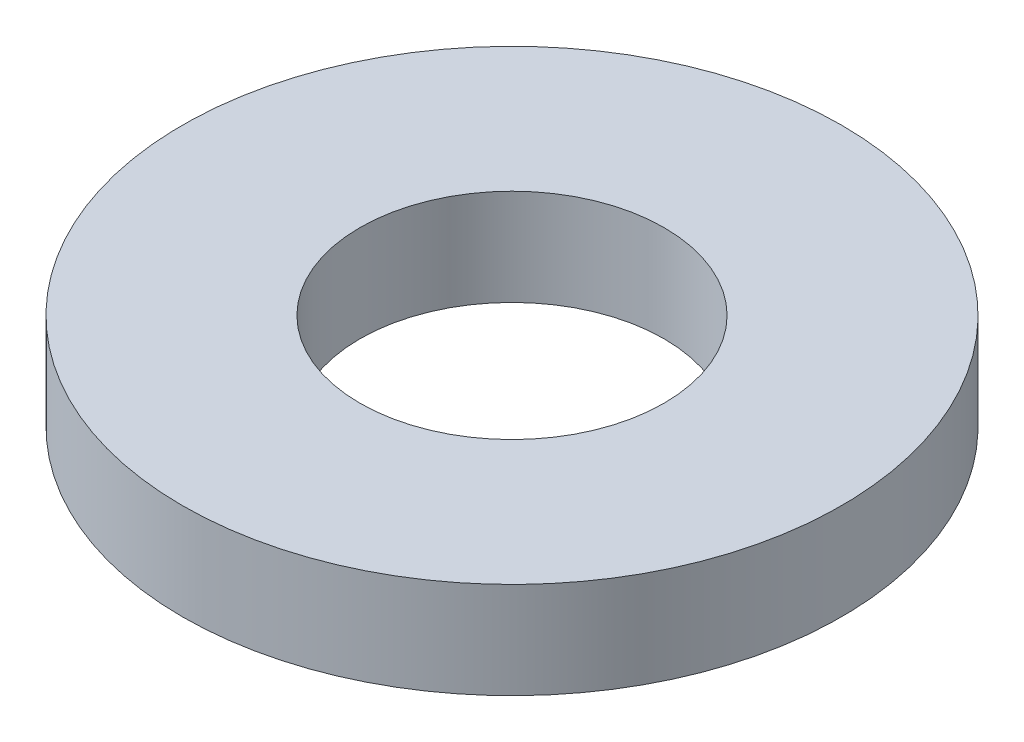
ISO-10303-21;
HEADER;
FILE_DESCRIPTION(('STEP AP214'),'2;1');
FILE_NAME('part.step','',(''),(''),'','','');
FILE_SCHEMA(('AUTOMOTIVE_DESIGN { 1 0 10303 214 1 1 1 1 }'));
ENDSEC;
DATA;
#1=APPLICATION_CONTEXT('core data for automotive mechanical design processes');
#2=APPLICATION_PROTOCOL_DEFINITION('international standard','automotive_design',2000,#1);
#3=PRODUCT_CONTEXT('',#1,'mechanical');
#4=PRODUCT('Part','Part','',(#3));
#5=PRODUCT_RELATED_PRODUCT_CATEGORY('part','',(#4));
#6=PRODUCT_DEFINITION_FORMATION('','',#4);
#7=PRODUCT_DEFINITION_CONTEXT('part definition',#1,'design');
#8=PRODUCT_DEFINITION('design','',#6,#7);
#9=PRODUCT_DEFINITION_SHAPE('','',#8);
#10=(LENGTH_UNIT() NAMED_UNIT(*) SI_UNIT(.MILLI.,.METRE.));
#11=(NAMED_UNIT(*) PLANE_ANGLE_UNIT() SI_UNIT($,.RADIAN.));
#12=(NAMED_UNIT(*) SI_UNIT($,.STERADIAN.) SOLID_ANGLE_UNIT());
#13=UNCERTAINTY_MEASURE_WITH_UNIT(LENGTH_MEASURE(1.E-05),#10,'distance_accuracy_value','');
#14=(GEOMETRIC_REPRESENTATION_CONTEXT(3) GLOBAL_UNCERTAINTY_ASSIGNED_CONTEXT((#13)) GLOBAL_UNIT_ASSIGNED_CONTEXT((#10,
#11,#12)) REPRESENTATION_CONTEXT('',''));
#15=CARTESIAN_POINT('',(0.,0.,0.));
#16=DIRECTION('',(0.,0.,1.));
#17=DIRECTION('',(1.,0.,0.));
#18=AXIS2_PLACEMENT_3D('',#15,#16,#17);
#19=CARTESIAN_POINT('',(0.,19.,0.));
#20=DIRECTION('',(0.,-1.,0.));
#21=DIRECTION('',(0.,0.,-1.));
#22=AXIS2_PLACEMENT_3D('',#19,#20,#21);
#23=CYLINDRICAL_SURFACE('',#22,65.);
#24=CARTESIAN_POINT('',(0.,19.,0.));
#25=DIRECTION('',(0.,1.,0.));
#26=DIRECTION('',(0.,0.,1.));
#27=AXIS2_PLACEMENT_3D('',#24,#25,#26);
#28=CIRCLE('',#27,65.);
#29=CARTESIAN_POINT('',(0.,19.,65.));
#30=VERTEX_POINT('',#29);
#31=EDGE_CURVE('E10',#30,#30,#28,.T.);
#32=ORIENTED_EDGE('',*,*,#31,.F.);
#33=EDGE_LOOP('',(#32));
#34=FACE_BOUND('',#33,.T.);
#35=CARTESIAN_POINT('',(0.,0.,0.));
#36=DIRECTION('',(0.,1.,0.));
#37=DIRECTION('',(0.,0.,1.));
#38=AXIS2_PLACEMENT_3D('',#35,#36,#37);
#39=CIRCLE('',#38,65.);
#40=CARTESIAN_POINT('',(0.,0.,65.));
#41=VERTEX_POINT('',#40);
#42=EDGE_CURVE('E37',#41,#41,#39,.T.);
#43=ORIENTED_EDGE('',*,*,#42,.T.);
#44=EDGE_LOOP('',(#43));
#45=FACE_BOUND('',#44,.T.);
#46=ADVANCED_FACE('F40',(#34,#45),#23,.T.);
#47=CARTESIAN_POINT('',(0.,19.,0.));
#48=DIRECTION('',(0.,1.,0.));
#49=DIRECTION('',(0.,0.,1.));
#50=AXIS2_PLACEMENT_3D('',#47,#48,#49);
#51=PLANE('',#50);
#52=CARTESIAN_POINT('',(0.,19.,0.));
#53=DIRECTION('',(0.,1.,0.));
#54=DIRECTION('',(0.,0.,1.));
#55=AXIS2_PLACEMENT_3D('',#52,#53,#54);
#56=CIRCLE('',#55,30.);
#57=CARTESIAN_POINT('',(0.,19.,30.));
#58=VERTEX_POINT('',#57);
#59=EDGE_CURVE('E50',#58,#58,#56,.T.);
#60=ORIENTED_EDGE('',*,*,#59,.F.);
#61=EDGE_LOOP('',(#60));
#62=FACE_BOUND('',#61,.T.);
#63=ORIENTED_EDGE('',*,*,#31,.T.);
#64=EDGE_LOOP('',(#63));
#65=FACE_BOUND('',#64,.T.);
#66=ADVANCED_FACE('F59',(#62,#65),#51,.T.);
#67=CARTESIAN_POINT('',(0.,0.,0.));
#68=DIRECTION('',(0.,1.,0.));
#69=DIRECTION('',(0.,0.,1.));
#70=AXIS2_PLACEMENT_3D('',#67,#68,#69);
#71=PLANE('',#70);
#72=CARTESIAN_POINT('',(0.,0.,0.));
#73=DIRECTION('',(0.,1.,0.));
#74=DIRECTION('',(0.,0.,1.));
#75=AXIS2_PLACEMENT_3D('',#72,#73,#74);
#76=CIRCLE('',#75,30.);
#77=CARTESIAN_POINT('',(0.,0.,30.));
#78=VERTEX_POINT('',#77);
#79=EDGE_CURVE('E47',#78,#78,#76,.T.);
#80=ORIENTED_EDGE('',*,*,#79,.T.);
#81=EDGE_LOOP('',(#80));
#82=FACE_BOUND('',#81,.T.);
#83=ORIENTED_EDGE('',*,*,#42,.F.);
#84=EDGE_LOOP('',(#83));
#85=FACE_BOUND('',#84,.T.);
#86=ADVANCED_FACE('F58',(#82,#85),#71,.F.);
#87=CARTESIAN_POINT('',(0.,19.,0.));
#88=DIRECTION('',(0.,-1.,0.));
#89=DIRECTION('',(0.,0.,-1.));
#90=AXIS2_PLACEMENT_3D('',#87,#88,#89);
#91=CYLINDRICAL_SURFACE('',#90,30.);
#92=ORIENTED_EDGE('',*,*,#59,.T.);
#93=EDGE_LOOP('',(#92));
#94=FACE_BOUND('',#93,.T.);
#95=ORIENTED_EDGE('',*,*,#79,.F.);
#96=EDGE_LOOP('',(#95));
#97=FACE_BOUND('',#96,.T.);
#98=ADVANCED_FACE('F54',(#94,#97),#91,.F.);
#99=CLOSED_SHELL('',(#46,#66,#86,#98));
#100=MANIFOLD_SOLID_BREP('B2',#99);
#101=ADVANCED_BREP_SHAPE_REPRESENTATION('',(#18,#100),#14);
#102=SHAPE_DEFINITION_REPRESENTATION(#9,#101);
ENDSEC;
END-ISO-10303-21;
